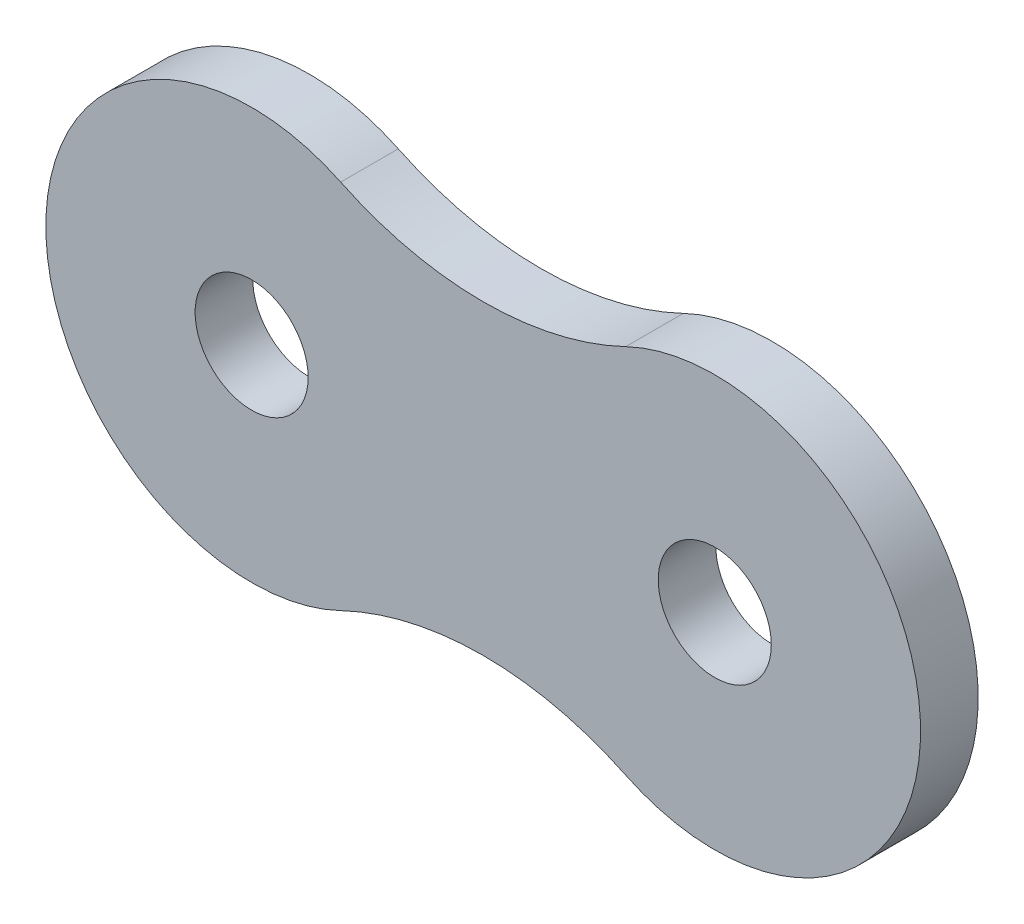
ISO-10303-21;
HEADER;
FILE_DESCRIPTION(('STEP AP214'),'2;1');
FILE_NAME('part.step','',(''),(''),'','','');
FILE_SCHEMA(('AUTOMOTIVE_DESIGN { 1 0 10303 214 1 1 1 1 }'));
ENDSEC;
DATA;
#1=APPLICATION_CONTEXT('core data for automotive mechanical design processes');
#2=APPLICATION_PROTOCOL_DEFINITION('international standard','automotive_design',2000,#1);
#3=PRODUCT_CONTEXT('',#1,'mechanical');
#4=PRODUCT('Part','Part','',(#3));
#5=PRODUCT_RELATED_PRODUCT_CATEGORY('part','',(#4));
#6=PRODUCT_DEFINITION_FORMATION('','',#4);
#7=PRODUCT_DEFINITION_CONTEXT('part definition',#1,'design');
#8=PRODUCT_DEFINITION('design','',#6,#7);
#9=PRODUCT_DEFINITION_SHAPE('','',#8);
#10=(LENGTH_UNIT() NAMED_UNIT(*) SI_UNIT(.MILLI.,.METRE.));
#11=(NAMED_UNIT(*) PLANE_ANGLE_UNIT() SI_UNIT($,.RADIAN.));
#12=(NAMED_UNIT(*) SI_UNIT($,.STERADIAN.) SOLID_ANGLE_UNIT());
#13=UNCERTAINTY_MEASURE_WITH_UNIT(LENGTH_MEASURE(1.E-05),#10,'distance_accuracy_value','');
#14=(GEOMETRIC_REPRESENTATION_CONTEXT(3) GLOBAL_UNCERTAINTY_ASSIGNED_CONTEXT((#13)) GLOBAL_UNIT_ASSIGNED_CONTEXT((#10,
#11,#12)) REPRESENTATION_CONTEXT('',''));
#15=CARTESIAN_POINT('',(0.,0.,0.));
#16=DIRECTION('',(0.,0.,1.));
#17=DIRECTION('',(1.,0.,0.));
#18=AXIS2_PLACEMENT_3D('',#15,#16,#17);
#19=CARTESIAN_POINT('',(-3.17500001337292,6.61539247535178,1.58));
#20=DIRECTION('',(0.,0.,1.));
#21=DIRECTION('',(1.,0.,0.));
#22=AXIS2_PLACEMENT_3D('',#19,#20,#21);
#23=PLANE('',#22);
#24=CARTESIAN_POINT('',(0.,0.,1.58));
#25=DIRECTION('',(0.,0.,1.));
#26=DIRECTION('',(1.,0.,0.));
#27=AXIS2_PLACEMENT_3D('',#24,#25,#26);
#28=CIRCLE('',#27,1.55);
#29=CARTESIAN_POINT('',(1.55,0.,1.58));
#30=VERTEX_POINT('',#29);
#31=EDGE_CURVE('E91',#30,#30,#28,.T.);
#32=ORIENTED_EDGE('',*,*,#31,.F.);
#33=EDGE_LOOP('',(#32));
#34=FACE_BOUND('',#33,.T.);
#35=CARTESIAN_POINT('',(-6.35000002674583,13.2307849507036,1.58));
#36=DIRECTION('',(0.,0.,-1.));
#37=DIRECTION('',(1.,0.,0.));
#38=AXIS2_PLACEMENT_3D('',#35,#36,#37);
#39=CIRCLE('',#38,9.03120000000016);
#40=CARTESIAN_POINT('',(-2.44230775196008,5.08876342496545,1.58));
#41=VERTEX_POINT('',#40);
#42=CARTESIAN_POINT('',(-10.2576923015316,5.08876342496545,1.58));
#43=VERTEX_POINT('',#42);
#44=EDGE_CURVE('E101',#41,#43,#39,.T.);
#45=ORIENTED_EDGE('',*,*,#44,.T.);
#46=CARTESIAN_POINT('',(-12.7,0.,1.58));
#47=DIRECTION('',(0.,0.,1.));
#48=DIRECTION('',(1.,0.,0.));
#49=AXIS2_PLACEMENT_3D('',#46,#47,#48);
#50=CIRCLE('',#49,5.64449998576173);
#51=CARTESIAN_POINT('',(-10.2576923015316,-5.08876342496545,1.58));
#52=VERTEX_POINT('',#51);
#53=EDGE_CURVE('E86',#43,#52,#50,.T.);
#54=ORIENTED_EDGE('',*,*,#53,.T.);
#55=CARTESIAN_POINT('',(-6.35000002674583,-13.2307851111119,1.58));
#56=DIRECTION('',(0.,0.,-1.));
#57=DIRECTION('',(1.,0.,0.));
#58=AXIS2_PLACEMENT_3D('',#55,#56,#57);
#59=CIRCLE('',#58,9.03120014461526);
#60=CARTESIAN_POINT('',(-2.44230775196009,-5.08876342496545,1.58));
#61=VERTEX_POINT('',#60);
#62=EDGE_CURVE('E52',#52,#61,#59,.T.);
#63=ORIENTED_EDGE('',*,*,#62,.T.);
#64=CARTESIAN_POINT('',(0.,0.,1.58));
#65=DIRECTION('',(0.,0.,1.));
#66=DIRECTION('',(1.,0.,0.));
#67=AXIS2_PLACEMENT_3D('',#64,#65,#66);
#68=CIRCLE('',#67,5.64450000890694);
#69=EDGE_CURVE('E47',#61,#41,#68,.T.);
#70=ORIENTED_EDGE('',*,*,#69,.T.);
#71=EDGE_LOOP('',(#45,#54,#63,#70));
#72=FACE_BOUND('',#71,.T.);
#73=CARTESIAN_POINT('',(-12.7,0.,1.58));
#74=DIRECTION('',(0.,0.,1.));
#75=DIRECTION('',(1.,0.,0.));
#76=AXIS2_PLACEMENT_3D('',#73,#74,#75);
#77=CIRCLE('',#76,1.55);
#78=CARTESIAN_POINT('',(-11.15,0.,1.58));
#79=VERTEX_POINT('',#78);
#80=EDGE_CURVE('E119',#79,#79,#77,.T.);
#81=ORIENTED_EDGE('',*,*,#80,.F.);
#82=EDGE_LOOP('',(#81));
#83=FACE_BOUND('',#82,.T.);
#84=ADVANCED_FACE('F32',(#34,#72,#83),#23,.T.);
#85=CARTESIAN_POINT('',(-3.17500001337292,6.61539247535178,0.));
#86=DIRECTION('',(0.,0.,1.));
#87=DIRECTION('',(1.,0.,0.));
#88=AXIS2_PLACEMENT_3D('',#85,#86,#87);
#89=PLANE('',#88);
#90=CARTESIAN_POINT('',(0.,0.,0.));
#91=DIRECTION('',(0.,0.,1.));
#92=DIRECTION('',(1.,0.,0.));
#93=AXIS2_PLACEMENT_3D('',#90,#91,#92);
#94=CIRCLE('',#93,1.55);
#95=CARTESIAN_POINT('',(1.55,0.,0.));
#96=VERTEX_POINT('',#95);
#97=EDGE_CURVE('E94',#96,#96,#94,.T.);
#98=ORIENTED_EDGE('',*,*,#97,.T.);
#99=EDGE_LOOP('',(#98));
#100=FACE_BOUND('',#99,.T.);
#101=CARTESIAN_POINT('',(-6.35000002674583,13.2307849507036,0.));
#102=DIRECTION('',(0.,0.,-1.));
#103=DIRECTION('',(1.,0.,0.));
#104=AXIS2_PLACEMENT_3D('',#101,#102,#103);
#105=CIRCLE('',#104,9.03120000000016);
#106=CARTESIAN_POINT('',(-2.44230775196008,5.08876342496545,0.));
#107=VERTEX_POINT('',#106);
#108=CARTESIAN_POINT('',(-10.2576923015316,5.08876342496545,0.));
#109=VERTEX_POINT('',#108);
#110=EDGE_CURVE('E78',#107,#109,#105,.T.);
#111=ORIENTED_EDGE('',*,*,#110,.F.);
#112=CARTESIAN_POINT('',(0.,0.,0.));
#113=DIRECTION('',(0.,0.,1.));
#114=DIRECTION('',(1.,0.,0.));
#115=AXIS2_PLACEMENT_3D('',#112,#113,#114);
#116=CIRCLE('',#115,5.64450000890694);
#117=CARTESIAN_POINT('',(-2.44230775196009,-5.08876342496545,0.));
#118=VERTEX_POINT('',#117);
#119=EDGE_CURVE('E99',#118,#107,#116,.T.);
#120=ORIENTED_EDGE('',*,*,#119,.F.);
#121=CARTESIAN_POINT('',(-6.35000002674583,-13.2307851111119,0.));
#122=DIRECTION('',(0.,0.,-1.));
#123=DIRECTION('',(1.,0.,0.));
#124=AXIS2_PLACEMENT_3D('',#121,#122,#123);
#125=CIRCLE('',#124,9.03120014461526);
#126=CARTESIAN_POINT('',(-10.2576923015316,-5.08876342496545,0.));
#127=VERTEX_POINT('',#126);
#128=EDGE_CURVE('E79',#127,#118,#125,.T.);
#129=ORIENTED_EDGE('',*,*,#128,.F.);
#130=CARTESIAN_POINT('',(-12.7,0.,0.));
#131=DIRECTION('',(0.,0.,1.));
#132=DIRECTION('',(1.,0.,0.));
#133=AXIS2_PLACEMENT_3D('',#130,#131,#132);
#134=CIRCLE('',#133,5.64449998576173);
#135=EDGE_CURVE('E73',#109,#127,#134,.T.);
#136=ORIENTED_EDGE('',*,*,#135,.F.);
#137=EDGE_LOOP('',(#111,#120,#129,#136));
#138=FACE_BOUND('',#137,.T.);
#139=CARTESIAN_POINT('',(-12.7,0.,0.));
#140=DIRECTION('',(0.,0.,1.));
#141=DIRECTION('',(1.,0.,0.));
#142=AXIS2_PLACEMENT_3D('',#139,#140,#141);
#143=CIRCLE('',#142,1.55);
#144=CARTESIAN_POINT('',(-11.15,0.,0.));
#145=VERTEX_POINT('',#144);
#146=EDGE_CURVE('E121',#145,#145,#143,.T.);
#147=ORIENTED_EDGE('',*,*,#146,.T.);
#148=EDGE_LOOP('',(#147));
#149=FACE_BOUND('',#148,.T.);
#150=ADVANCED_FACE('F74',(#100,#138,#149),#89,.F.);
#151=CARTESIAN_POINT('',(-6.35000002674583,13.2307849507036,1.58));
#152=DIRECTION('',(0.,0.,-1.));
#153=DIRECTION('',(-1.,0.,0.));
#154=AXIS2_PLACEMENT_3D('',#151,#152,#153);
#155=CYLINDRICAL_SURFACE('',#154,9.03120000000016);
#156=ORIENTED_EDGE('',*,*,#110,.T.);
#157=DIRECTION('',(0.,0.,-1.));
#158=VECTOR('',#157,1.);
#159=CARTESIAN_POINT('',(-10.2576923015316,5.08876342496545,1.58));
#160=LINE('',#159,#158);
#161=EDGE_CURVE('E11',#43,#109,#160,.T.);
#162=ORIENTED_EDGE('',*,*,#161,.F.);
#163=ORIENTED_EDGE('',*,*,#44,.F.);
#164=DIRECTION('',(0.,0.,-1.));
#165=VECTOR('',#164,1.);
#166=CARTESIAN_POINT('',(-2.44230775196008,5.08876342496545,1.58));
#167=LINE('',#166,#165);
#168=EDGE_CURVE('E90',#41,#107,#167,.T.);
#169=ORIENTED_EDGE('',*,*,#168,.T.);
#170=EDGE_LOOP('',(#156,#162,#163,#169));
#171=FACE_BOUND('',#170,.T.);
#172=ADVANCED_FACE('F34',(#171),#155,.F.);
#173=CARTESIAN_POINT('',(-12.7,0.,1.58));
#174=DIRECTION('',(0.,0.,-1.));
#175=DIRECTION('',(-1.,0.,0.));
#176=AXIS2_PLACEMENT_3D('',#173,#174,#175);
#177=CYLINDRICAL_SURFACE('',#176,5.64449998576173);
#178=ORIENTED_EDGE('',*,*,#135,.T.);
#179=DIRECTION('',(0.,0.,-1.));
#180=VECTOR('',#179,1.);
#181=CARTESIAN_POINT('',(-10.2576923015316,-5.08876342496545,1.58));
#182=LINE('',#181,#180);
#183=EDGE_CURVE('E40',#52,#127,#182,.T.);
#184=ORIENTED_EDGE('',*,*,#183,.F.);
#185=ORIENTED_EDGE('',*,*,#53,.F.);
#186=ORIENTED_EDGE('',*,*,#161,.T.);
#187=EDGE_LOOP('',(#178,#184,#185,#186));
#188=FACE_BOUND('',#187,.T.);
#189=ADVANCED_FACE('F85',(#188),#177,.T.);
#190=CARTESIAN_POINT('',(-6.35000002674583,-13.2307851111119,1.58));
#191=DIRECTION('',(0.,0.,-1.));
#192=DIRECTION('',(-1.,0.,0.));
#193=AXIS2_PLACEMENT_3D('',#190,#191,#192);
#194=CYLINDRICAL_SURFACE('',#193,9.03120014461526);
#195=ORIENTED_EDGE('',*,*,#128,.T.);
#196=DIRECTION('',(0.,0.,-1.));
#197=VECTOR('',#196,1.);
#198=CARTESIAN_POINT('',(-2.44230775196009,-5.08876342496545,1.58));
#199=LINE('',#198,#197);
#200=EDGE_CURVE('E107',#61,#118,#199,.T.);
#201=ORIENTED_EDGE('',*,*,#200,.F.);
#202=ORIENTED_EDGE('',*,*,#62,.F.);
#203=ORIENTED_EDGE('',*,*,#183,.T.);
#204=EDGE_LOOP('',(#195,#201,#202,#203));
#205=FACE_BOUND('',#204,.T.);
#206=ADVANCED_FACE('F110',(#205),#194,.F.);
#207=CARTESIAN_POINT('',(0.,0.,1.58));
#208=DIRECTION('',(0.,0.,-1.));
#209=DIRECTION('',(-1.,0.,0.));
#210=AXIS2_PLACEMENT_3D('',#207,#208,#209);
#211=CYLINDRICAL_SURFACE('',#210,5.64450000890694);
#212=ORIENTED_EDGE('',*,*,#119,.T.);
#213=ORIENTED_EDGE('',*,*,#168,.F.);
#214=ORIENTED_EDGE('',*,*,#69,.F.);
#215=ORIENTED_EDGE('',*,*,#200,.T.);
#216=EDGE_LOOP('',(#212,#213,#214,#215));
#217=FACE_BOUND('',#216,.T.);
#218=ADVANCED_FACE('F112',(#217),#211,.T.);
#219=CARTESIAN_POINT('',(0.,0.,1.58));
#220=DIRECTION('',(0.,0.,-1.));
#221=DIRECTION('',(-1.,0.,0.));
#222=AXIS2_PLACEMENT_3D('',#219,#220,#221);
#223=CYLINDRICAL_SURFACE('',#222,1.55);
#224=ORIENTED_EDGE('',*,*,#31,.T.);
#225=EDGE_LOOP('',(#224));
#226=FACE_BOUND('',#225,.T.);
#227=ORIENTED_EDGE('',*,*,#97,.F.);
#228=EDGE_LOOP('',(#227));
#229=FACE_BOUND('',#228,.T.);
#230=ADVANCED_FACE('F130',(#226,#229),#223,.F.);
#231=CARTESIAN_POINT('',(-12.7,0.,1.58));
#232=DIRECTION('',(0.,0.,-1.));
#233=DIRECTION('',(-1.,0.,0.));
#234=AXIS2_PLACEMENT_3D('',#231,#232,#233);
#235=CYLINDRICAL_SURFACE('',#234,1.55);
#236=ORIENTED_EDGE('',*,*,#80,.T.);
#237=EDGE_LOOP('',(#236));
#238=FACE_BOUND('',#237,.T.);
#239=ORIENTED_EDGE('',*,*,#146,.F.);
#240=EDGE_LOOP('',(#239));
#241=FACE_BOUND('',#240,.T.);
#242=ADVANCED_FACE('F128',(#238,#241),#235,.F.);
#243=CLOSED_SHELL('',(#84,#150,#172,#189,#206,#218,#230,#242));
#244=MANIFOLD_SOLID_BREP('B2',#243);
#245=ADVANCED_BREP_SHAPE_REPRESENTATION('',(#18,#244),#14);
#246=SHAPE_DEFINITION_REPRESENTATION(#9,#245);
ENDSEC;
END-ISO-10303-21;
